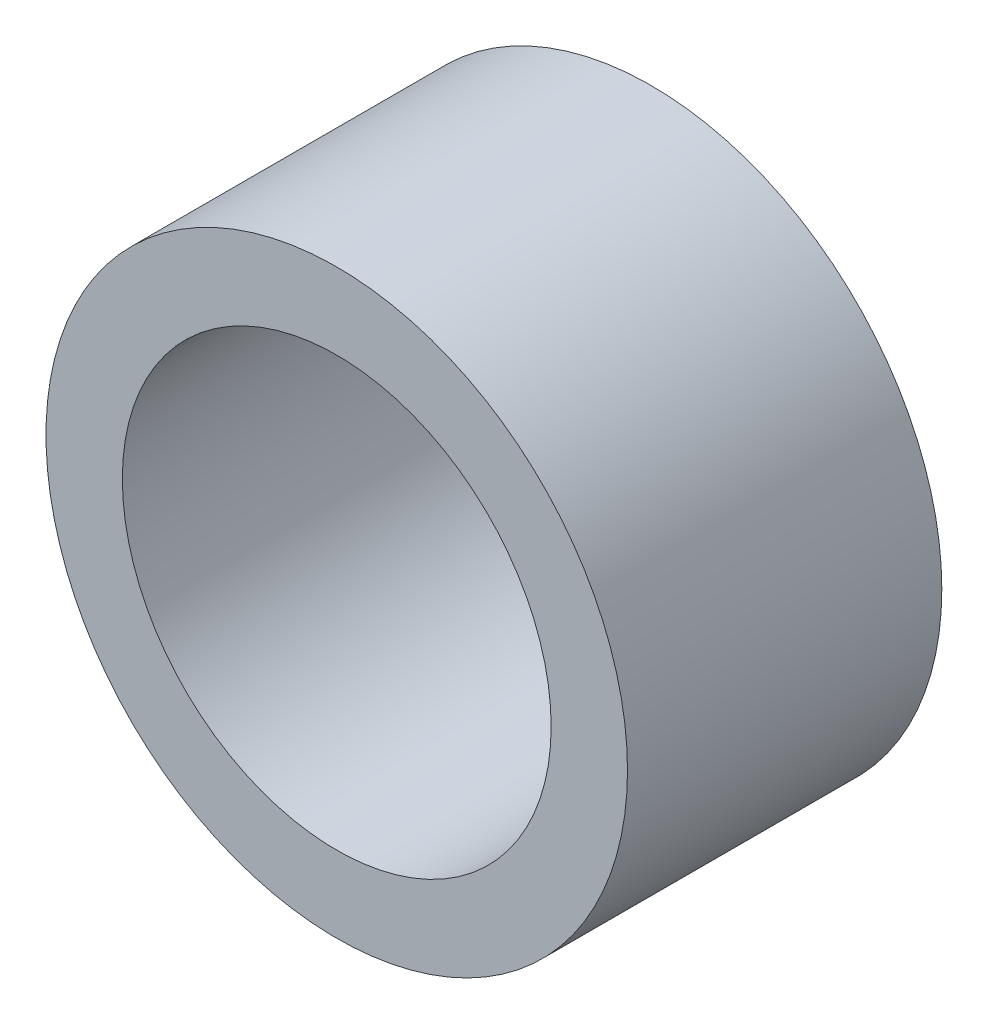
ISO-10303-21;
HEADER;
FILE_DESCRIPTION(('STEP AP214'),'2;1');
FILE_NAME('part.step','',(''),(''),'','','');
FILE_SCHEMA(('AUTOMOTIVE_DESIGN { 1 0 10303 214 1 1 1 1 }'));
ENDSEC;
DATA;
#1=APPLICATION_CONTEXT('core data for automotive mechanical design processes');
#2=APPLICATION_PROTOCOL_DEFINITION('international standard','automotive_design',2000,#1);
#3=PRODUCT_CONTEXT('',#1,'mechanical');
#4=PRODUCT('Part','Part','',(#3));
#5=PRODUCT_RELATED_PRODUCT_CATEGORY('part','',(#4));
#6=PRODUCT_DEFINITION_FORMATION('','',#4);
#7=PRODUCT_DEFINITION_CONTEXT('part definition',#1,'design');
#8=PRODUCT_DEFINITION('design','',#6,#7);
#9=PRODUCT_DEFINITION_SHAPE('','',#8);
#10=(LENGTH_UNIT() NAMED_UNIT(*) SI_UNIT(.MILLI.,.METRE.));
#11=(NAMED_UNIT(*) PLANE_ANGLE_UNIT() SI_UNIT($,.RADIAN.));
#12=(NAMED_UNIT(*) SI_UNIT($,.STERADIAN.) SOLID_ANGLE_UNIT());
#13=UNCERTAINTY_MEASURE_WITH_UNIT(LENGTH_MEASURE(1.E-05),#10,'distance_accuracy_value','');
#14=(GEOMETRIC_REPRESENTATION_CONTEXT(3) GLOBAL_UNCERTAINTY_ASSIGNED_CONTEXT((#13)) GLOBAL_UNIT_ASSIGNED_CONTEXT((#10,
#11,#12)) REPRESENTATION_CONTEXT('',''));
#15=CARTESIAN_POINT('',(0.,0.,0.));
#16=DIRECTION('',(0.,0.,1.));
#17=DIRECTION('',(1.,0.,0.));
#18=AXIS2_PLACEMENT_3D('',#15,#16,#17);
#19=CARTESIAN_POINT('',(0.,0.,7.112));
#20=DIRECTION('',(0.,0.,1.));
#21=DIRECTION('',(1.,0.,0.));
#22=AXIS2_PLACEMENT_3D('',#19,#20,#21);
#23=PLANE('',#22);
#24=CARTESIAN_POINT('',(0.,0.,7.112));
#25=DIRECTION('',(0.,0.,1.));
#26=DIRECTION('',(1.,0.,0.));
#27=AXIS2_PLACEMENT_3D('',#24,#25,#26);
#28=CIRCLE('',#27,6.5786);
#29=CARTESIAN_POINT('',(6.5786,0.,7.112));
#30=VERTEX_POINT('',#29);
#31=EDGE_CURVE('E10',#30,#30,#28,.T.);
#32=ORIENTED_EDGE('',*,*,#31,.T.);
#33=EDGE_LOOP('',(#32));
#34=FACE_BOUND('',#33,.T.);
#35=CARTESIAN_POINT('',(0.,0.,7.112));
#36=DIRECTION('',(0.,0.,1.));
#37=DIRECTION('',(1.,0.,0.));
#38=AXIS2_PLACEMENT_3D('',#35,#36,#37);
#39=CIRCLE('',#38,4.8514);
#40=CARTESIAN_POINT('',(4.8514,0.,7.112));
#41=VERTEX_POINT('',#40);
#42=EDGE_CURVE('E41',#41,#41,#39,.T.);
#43=ORIENTED_EDGE('',*,*,#42,.F.);
#44=EDGE_LOOP('',(#43));
#45=FACE_BOUND('',#44,.T.);
#46=ADVANCED_FACE('F30',(#34,#45),#23,.T.);
#47=CARTESIAN_POINT('',(0.,0.,0.));
#48=DIRECTION('',(0.,0.,1.));
#49=DIRECTION('',(1.,0.,0.));
#50=AXIS2_PLACEMENT_3D('',#47,#48,#49);
#51=PLANE('',#50);
#52=CARTESIAN_POINT('',(0.,0.,0.));
#53=DIRECTION('',(0.,0.,1.));
#54=DIRECTION('',(1.,0.,0.));
#55=AXIS2_PLACEMENT_3D('',#52,#53,#54);
#56=CIRCLE('',#55,6.5786);
#57=CARTESIAN_POINT('',(6.5786,0.,0.));
#58=VERTEX_POINT('',#57);
#59=EDGE_CURVE('E34',#58,#58,#56,.T.);
#60=ORIENTED_EDGE('',*,*,#59,.F.);
#61=EDGE_LOOP('',(#60));
#62=FACE_BOUND('',#61,.T.);
#63=CARTESIAN_POINT('',(0.,0.,0.));
#64=DIRECTION('',(0.,0.,1.));
#65=DIRECTION('',(1.,0.,0.));
#66=AXIS2_PLACEMENT_3D('',#63,#64,#65);
#67=CIRCLE('',#66,4.8514);
#68=CARTESIAN_POINT('',(4.8514,0.,0.));
#69=VERTEX_POINT('',#68);
#70=EDGE_CURVE('E43',#69,#69,#67,.T.);
#71=ORIENTED_EDGE('',*,*,#70,.T.);
#72=EDGE_LOOP('',(#71));
#73=FACE_BOUND('',#72,.T.);
#74=ADVANCED_FACE('F53',(#62,#73),#51,.F.);
#75=CARTESIAN_POINT('',(0.,0.,7.112));
#76=DIRECTION('',(0.,0.,-1.));
#77=DIRECTION('',(-1.,0.,0.));
#78=AXIS2_PLACEMENT_3D('',#75,#76,#77);
#79=CYLINDRICAL_SURFACE('',#78,6.5786);
#80=ORIENTED_EDGE('',*,*,#31,.F.);
#81=EDGE_LOOP('',(#80));
#82=FACE_BOUND('',#81,.T.);
#83=ORIENTED_EDGE('',*,*,#59,.T.);
#84=EDGE_LOOP('',(#83));
#85=FACE_BOUND('',#84,.T.);
#86=ADVANCED_FACE('F32',(#82,#85),#79,.T.);
#87=CARTESIAN_POINT('',(0.,0.,7.112));
#88=DIRECTION('',(0.,0.,-1.));
#89=DIRECTION('',(-1.,0.,0.));
#90=AXIS2_PLACEMENT_3D('',#87,#88,#89);
#91=CYLINDRICAL_SURFACE('',#90,4.8514);
#92=ORIENTED_EDGE('',*,*,#42,.T.);
#93=EDGE_LOOP('',(#92));
#94=FACE_BOUND('',#93,.T.);
#95=ORIENTED_EDGE('',*,*,#70,.F.);
#96=EDGE_LOOP('',(#95));
#97=FACE_BOUND('',#96,.T.);
#98=ADVANCED_FACE('F49',(#94,#97),#91,.F.);
#99=CLOSED_SHELL('',(#46,#74,#86,#98));
#100=MANIFOLD_SOLID_BREP('B2',#99);
#101=ADVANCED_BREP_SHAPE_REPRESENTATION('',(#18,#100),#14);
#102=SHAPE_DEFINITION_REPRESENTATION(#9,#101);
ENDSEC;
END-ISO-10303-21;
